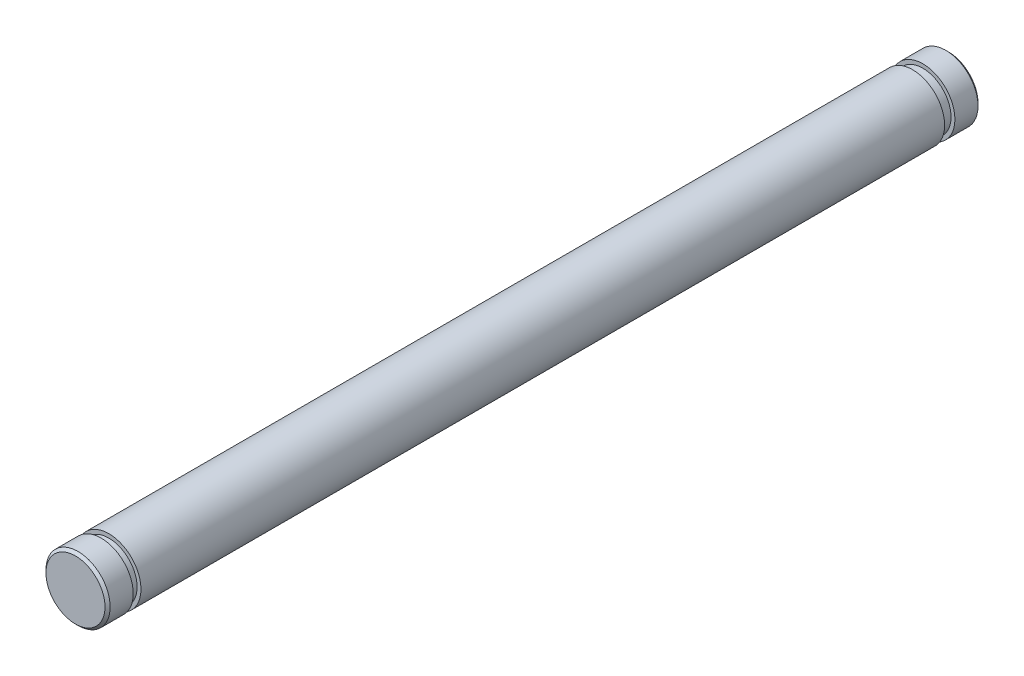
ISO-10303-21;
HEADER;
FILE_DESCRIPTION(('STEP AP214'),'2;1');
FILE_NAME('part.step','',(''),(''),'','','');
FILE_SCHEMA(('AUTOMOTIVE_DESIGN { 1 0 10303 214 1 1 1 1 }'));
ENDSEC;
DATA;
#1=APPLICATION_CONTEXT('core data for automotive mechanical design processes');
#2=APPLICATION_PROTOCOL_DEFINITION('international standard','automotive_design',2000,#1);
#3=PRODUCT_CONTEXT('',#1,'mechanical');
#4=PRODUCT('Part','Part','',(#3));
#5=PRODUCT_RELATED_PRODUCT_CATEGORY('part','',(#4));
#6=PRODUCT_DEFINITION_FORMATION('','',#4);
#7=PRODUCT_DEFINITION_CONTEXT('part definition',#1,'design');
#8=PRODUCT_DEFINITION('design','',#6,#7);
#9=PRODUCT_DEFINITION_SHAPE('','',#8);
#10=(LENGTH_UNIT() NAMED_UNIT(*) SI_UNIT(.MILLI.,.METRE.));
#11=(NAMED_UNIT(*) PLANE_ANGLE_UNIT() SI_UNIT($,.RADIAN.));
#12=(NAMED_UNIT(*) SI_UNIT($,.STERADIAN.) SOLID_ANGLE_UNIT());
#13=UNCERTAINTY_MEASURE_WITH_UNIT(LENGTH_MEASURE(1.E-05),#10,'distance_accuracy_value','');
#14=(GEOMETRIC_REPRESENTATION_CONTEXT(3) GLOBAL_UNCERTAINTY_ASSIGNED_CONTEXT((#13)) GLOBAL_UNIT_ASSIGNED_CONTEXT((#10,
#11,#12)) REPRESENTATION_CONTEXT('',''));
#15=CARTESIAN_POINT('',(0.,0.,0.));
#16=DIRECTION('',(0.,0.,1.));
#17=DIRECTION('',(1.,0.,0.));
#18=AXIS2_PLACEMENT_3D('',#15,#16,#17);
#19=CARTESIAN_POINT('',(0.,0.,34.));
#20=DIRECTION('',(0.,0.,-1.));
#21=DIRECTION('',(-1.,0.,0.));
#22=AXIS2_PLACEMENT_3D('',#19,#20,#21);
#23=CYLINDRICAL_SURFACE('',#22,1.25);
#24=CARTESIAN_POINT('',(0.,0.,1.4));
#25=DIRECTION('',(0.,0.,1.));
#26=DIRECTION('',(1.,0.,0.));
#27=AXIS2_PLACEMENT_3D('',#24,#25,#26);
#28=CIRCLE('',#27,1.25);
#29=CARTESIAN_POINT('',(1.25,0.,1.4));
#30=VERTEX_POINT('',#29);
#31=EDGE_CURVE('E52',#30,#30,#28,.T.);
#32=ORIENTED_EDGE('',*,*,#31,.T.);
#33=EDGE_LOOP('',(#32));
#34=FACE_BOUND('',#33,.T.);
#35=CARTESIAN_POINT('',(0.,0.,32.7));
#36=DIRECTION('',(0.,0.,1.));
#37=DIRECTION('',(1.,0.,0.));
#38=AXIS2_PLACEMENT_3D('',#35,#36,#37);
#39=CIRCLE('',#38,1.25);
#40=CARTESIAN_POINT('',(1.25,0.,32.7));
#41=VERTEX_POINT('',#40);
#42=EDGE_CURVE('E62',#41,#41,#39,.T.);
#43=ORIENTED_EDGE('',*,*,#42,.F.);
#44=EDGE_LOOP('',(#43));
#45=FACE_BOUND('',#44,.T.);
#46=ADVANCED_FACE('F32',(#34,#45),#23,.T.);
#47=CARTESIAN_POINT('',(0.,0.,1.4));
#48=DIRECTION('',(0.,0.,1.));
#49=DIRECTION('',(1.,0.,0.));
#50=AXIS2_PLACEMENT_3D('',#47,#48,#49);
#51=PLANE('',#50);
#52=ORIENTED_EDGE('',*,*,#31,.F.);
#53=EDGE_LOOP('',(#52));
#54=FACE_BOUND('',#53,.T.);
#55=CARTESIAN_POINT('',(0.,0.,1.4));
#56=DIRECTION('',(0.,0.,1.));
#57=DIRECTION('',(1.,0.,0.));
#58=AXIS2_PLACEMENT_3D('',#55,#56,#57);
#59=CIRCLE('',#58,1.1);
#60=CARTESIAN_POINT('',(1.1,0.,1.4));
#61=VERTEX_POINT('',#60);
#62=EDGE_CURVE('E56',#61,#61,#59,.T.);
#63=ORIENTED_EDGE('',*,*,#62,.T.);
#64=EDGE_LOOP('',(#63));
#65=FACE_BOUND('',#64,.T.);
#66=ADVANCED_FACE('F89',(#54,#65),#51,.F.);
#67=CARTESIAN_POINT('',(0.,0.,1.));
#68=DIRECTION('',(0.,0.,1.));
#69=DIRECTION('',(1.,0.,0.));
#70=AXIS2_PLACEMENT_3D('',#67,#68,#69);
#71=PLANE('',#70);
#72=CARTESIAN_POINT('',(0.,0.,1.));
#73=DIRECTION('',(0.,0.,1.));
#74=DIRECTION('',(1.,0.,0.));
#75=AXIS2_PLACEMENT_3D('',#72,#73,#74);
#76=CIRCLE('',#75,1.25);
#77=CARTESIAN_POINT('',(1.25,0.,1.));
#78=VERTEX_POINT('',#77);
#79=EDGE_CURVE('E53',#78,#78,#76,.T.);
#80=ORIENTED_EDGE('',*,*,#79,.T.);
#81=EDGE_LOOP('',(#80));
#82=FACE_BOUND('',#81,.T.);
#83=CARTESIAN_POINT('',(0.,0.,1.));
#84=DIRECTION('',(0.,0.,1.));
#85=DIRECTION('',(1.,0.,0.));
#86=AXIS2_PLACEMENT_3D('',#83,#84,#85);
#87=CIRCLE('',#86,1.1);
#88=CARTESIAN_POINT('',(1.1,0.,1.));
#89=VERTEX_POINT('',#88);
#90=EDGE_CURVE('E59',#89,#89,#87,.T.);
#91=ORIENTED_EDGE('',*,*,#90,.F.);
#92=EDGE_LOOP('',(#91));
#93=FACE_BOUND('',#92,.T.);
#94=ADVANCED_FACE('F96',(#82,#93),#71,.T.);
#95=CARTESIAN_POINT('',(0.,0.,1.4));
#96=DIRECTION('',(0.,0.,-1.));
#97=DIRECTION('',(-1.,0.,0.));
#98=AXIS2_PLACEMENT_3D('',#95,#96,#97);
#99=CYLINDRICAL_SURFACE('',#98,1.1);
#100=ORIENTED_EDGE('',*,*,#62,.F.);
#101=EDGE_LOOP('',(#100));
#102=FACE_BOUND('',#101,.T.);
#103=ORIENTED_EDGE('',*,*,#90,.T.);
#104=EDGE_LOOP('',(#103));
#105=FACE_BOUND('',#104,.T.);
#106=ADVANCED_FACE('F123',(#102,#105),#99,.T.);
#107=CARTESIAN_POINT('',(0.,0.,0.));
#108=DIRECTION('',(0.,0.,1.));
#109=DIRECTION('',(1.,0.,0.));
#110=AXIS2_PLACEMENT_3D('',#107,#108,#109);
#111=PLANE('',#110);
#112=CARTESIAN_POINT('',(0.,0.,0.));
#113=DIRECTION('',(0.,0.,1.));
#114=DIRECTION('',(1.,0.,0.));
#115=AXIS2_PLACEMENT_3D('',#112,#113,#114);
#116=CIRCLE('',#115,1.15);
#117=CARTESIAN_POINT('',(1.15,0.,0.));
#118=VERTEX_POINT('',#117);
#119=EDGE_CURVE('E43',#118,#118,#116,.F.);
#120=ORIENTED_EDGE('',*,*,#119,.T.);
#121=EDGE_LOOP('',(#120));
#122=FACE_BOUND('',#121,.T.);
#123=ADVANCED_FACE('F101',(#122),#111,.F.);
#124=CARTESIAN_POINT('',(0.,0.,0.100000000000003));
#125=DIRECTION('',(0.,0.,1.));
#126=DIRECTION('',(1.,0.,0.));
#127=AXIS2_PLACEMENT_3D('',#124,#125,#126);
#128=CIRCLE('',#127,1.25);
#129=CARTESIAN_POINT('',(1.25,0.,0.100000000000003));
#130=VERTEX_POINT('',#129);
#131=EDGE_CURVE('E47',#130,#130,#128,.T.);
#132=ORIENTED_EDGE('',*,*,#131,.T.);
#133=EDGE_LOOP('',(#132));
#134=FACE_BOUND('',#133,.T.);
#135=ORIENTED_EDGE('',*,*,#79,.F.);
#136=EDGE_LOOP('',(#135));
#137=FACE_BOUND('',#136,.T.);
#138=ADVANCED_FACE('F84',(#134,#137),#23,.T.);
#139=CARTESIAN_POINT('',(0.,0.,32.7));
#140=DIRECTION('',(0.,0.,1.));
#141=DIRECTION('',(1.,0.,0.));
#142=AXIS2_PLACEMENT_3D('',#139,#140,#141);
#143=PLANE('',#142);
#144=CARTESIAN_POINT('',(0.,0.,32.7));
#145=DIRECTION('',(0.,0.,1.));
#146=DIRECTION('',(1.,0.,0.));
#147=AXIS2_PLACEMENT_3D('',#144,#145,#146);
#148=CIRCLE('',#147,1.1);
#149=CARTESIAN_POINT('',(1.1,0.,32.7));
#150=VERTEX_POINT('',#149);
#151=EDGE_CURVE('E68',#150,#150,#148,.T.);
#152=ORIENTED_EDGE('',*,*,#151,.F.);
#153=EDGE_LOOP('',(#152));
#154=FACE_BOUND('',#153,.T.);
#155=ORIENTED_EDGE('',*,*,#42,.T.);
#156=EDGE_LOOP('',(#155));
#157=FACE_BOUND('',#156,.T.);
#158=ADVANCED_FACE('F80',(#154,#157),#143,.T.);
#159=CARTESIAN_POINT('',(0.,0.,33.));
#160=DIRECTION('',(0.,0.,1.));
#161=DIRECTION('',(1.,0.,0.));
#162=AXIS2_PLACEMENT_3D('',#159,#160,#161);
#163=PLANE('',#162);
#164=CARTESIAN_POINT('',(0.,0.,33.));
#165=DIRECTION('',(0.,0.,1.));
#166=DIRECTION('',(1.,0.,0.));
#167=AXIS2_PLACEMENT_3D('',#164,#165,#166);
#168=CIRCLE('',#167,1.1);
#169=CARTESIAN_POINT('',(1.1,0.,33.));
#170=VERTEX_POINT('',#169);
#171=EDGE_CURVE('E71',#170,#170,#168,.T.);
#172=ORIENTED_EDGE('',*,*,#171,.T.);
#173=EDGE_LOOP('',(#172));
#174=FACE_BOUND('',#173,.T.);
#175=CARTESIAN_POINT('',(0.,0.,33.));
#176=DIRECTION('',(0.,0.,1.));
#177=DIRECTION('',(1.,0.,0.));
#178=AXIS2_PLACEMENT_3D('',#175,#176,#177);
#179=CIRCLE('',#178,1.25);
#180=CARTESIAN_POINT('',(1.25,0.,33.));
#181=VERTEX_POINT('',#180);
#182=EDGE_CURVE('E65',#181,#181,#179,.T.);
#183=ORIENTED_EDGE('',*,*,#182,.F.);
#184=EDGE_LOOP('',(#183));
#185=FACE_BOUND('',#184,.T.);
#186=ADVANCED_FACE('F83',(#174,#185),#163,.F.);
#187=CARTESIAN_POINT('',(0.,0.,32.7));
#188=DIRECTION('',(0.,0.,1.));
#189=DIRECTION('',(1.,0.,0.));
#190=AXIS2_PLACEMENT_3D('',#187,#188,#189);
#191=CYLINDRICAL_SURFACE('',#190,1.1);
#192=ORIENTED_EDGE('',*,*,#151,.T.);
#193=EDGE_LOOP('',(#192));
#194=FACE_BOUND('',#193,.T.);
#195=ORIENTED_EDGE('',*,*,#171,.F.);
#196=EDGE_LOOP('',(#195));
#197=FACE_BOUND('',#196,.T.);
#198=ADVANCED_FACE('F77',(#194,#197),#191,.T.);
#199=CARTESIAN_POINT('',(0.,0.,34.));
#200=DIRECTION('',(0.,0.,1.));
#201=DIRECTION('',(1.,0.,0.));
#202=AXIS2_PLACEMENT_3D('',#199,#200,#201);
#203=PLANE('',#202);
#204=CARTESIAN_POINT('',(0.,0.,34.));
#205=DIRECTION('',(0.,0.,1.));
#206=DIRECTION('',(1.,0.,0.));
#207=AXIS2_PLACEMENT_3D('',#204,#205,#206);
#208=CIRCLE('',#207,1.14999999999999);
#209=CARTESIAN_POINT('',(1.14999999999999,0.,34.));
#210=VERTEX_POINT('',#209);
#211=EDGE_CURVE('E39',#210,#210,#208,.T.);
#212=ORIENTED_EDGE('',*,*,#211,.T.);
#213=EDGE_LOOP('',(#212));
#214=FACE_BOUND('',#213,.T.);
#215=ADVANCED_FACE('F105',(#214),#203,.T.);
#216=CARTESIAN_POINT('',(0.,0.,33.9));
#217=DIRECTION('',(0.,0.,1.));
#218=DIRECTION('',(1.,0.,0.));
#219=AXIS2_PLACEMENT_3D('',#216,#217,#218);
#220=CIRCLE('',#219,1.25);
#221=CARTESIAN_POINT('',(1.25,0.,33.9));
#222=VERTEX_POINT('',#221);
#223=EDGE_CURVE('E10',#222,#222,#220,.F.);
#224=ORIENTED_EDGE('',*,*,#223,.T.);
#225=EDGE_LOOP('',(#224));
#226=FACE_BOUND('',#225,.T.);
#227=ORIENTED_EDGE('',*,*,#182,.T.);
#228=EDGE_LOOP('',(#227));
#229=FACE_BOUND('',#228,.T.);
#230=ADVANCED_FACE('F92',(#226,#229),#23,.T.);
#231=CARTESIAN_POINT('',(0.,0.,0.100000000000003));
#232=DIRECTION('',(0.,0.,1.));
#233=DIRECTION('',(1.,0.,0.));
#234=AXIS2_PLACEMENT_3D('',#231,#232,#233);
#235=CONICAL_SURFACE('',#234,1.25,0.785398163397443);
#236=ORIENTED_EDGE('',*,*,#119,.F.);
#237=EDGE_LOOP('',(#236));
#238=FACE_BOUND('',#237,.T.);
#239=ORIENTED_EDGE('',*,*,#131,.F.);
#240=EDGE_LOOP('',(#239));
#241=FACE_BOUND('',#240,.T.);
#242=ADVANCED_FACE('F104',(#238,#241),#235,.T.);
#243=CARTESIAN_POINT('',(0.,0.,34.));
#244=DIRECTION('',(0.,0.,-1.));
#245=DIRECTION('',(-1.,0.,0.));
#246=AXIS2_PLACEMENT_3D('',#243,#244,#245);
#247=CONICAL_SURFACE('',#246,1.14999999999999,0.785398163397426);
#248=ORIENTED_EDGE('',*,*,#223,.F.);
#249=EDGE_LOOP('',(#248));
#250=FACE_BOUND('',#249,.T.);
#251=ORIENTED_EDGE('',*,*,#211,.F.);
#252=EDGE_LOOP('',(#251));
#253=FACE_BOUND('',#252,.T.);
#254=ADVANCED_FACE('F34',(#250,#253),#247,.T.);
#255=CLOSED_SHELL('',(#46,#66,#94,#106,#123,#138,#158,#186,#198,#215,#230,#242,#254));
#256=MANIFOLD_SOLID_BREP('B2',#255);
#257=ADVANCED_BREP_SHAPE_REPRESENTATION('',(#18,#256),#14);
#258=SHAPE_DEFINITION_REPRESENTATION(#9,#257);
ENDSEC;
END-ISO-10303-21;
